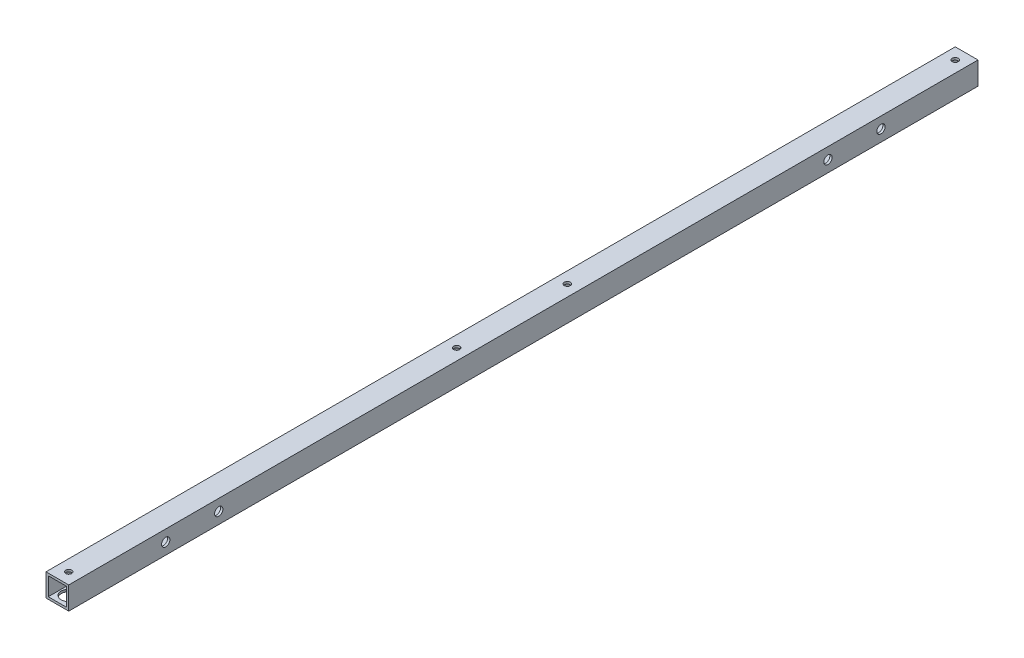
ISO-10303-21;
HEADER;
FILE_DESCRIPTION(('STEP AP214'),'2;1');
FILE_NAME('part.step','',(''),(''),'','','');
FILE_SCHEMA(('AUTOMOTIVE_DESIGN { 1 0 10303 214 1 1 1 1 }'));
ENDSEC;
DATA;
#1=APPLICATION_CONTEXT('core data for automotive mechanical design processes');
#2=APPLICATION_PROTOCOL_DEFINITION('international standard','automotive_design',2000,#1);
#3=PRODUCT_CONTEXT('',#1,'mechanical');
#4=PRODUCT('Part','Part','',(#3));
#5=PRODUCT_RELATED_PRODUCT_CATEGORY('part','',(#4));
#6=PRODUCT_DEFINITION_FORMATION('','',#4);
#7=PRODUCT_DEFINITION_CONTEXT('part definition',#1,'design');
#8=PRODUCT_DEFINITION('design','',#6,#7);
#9=PRODUCT_DEFINITION_SHAPE('','',#8);
#10=(LENGTH_UNIT() NAMED_UNIT(*) SI_UNIT(.MILLI.,.METRE.));
#11=(NAMED_UNIT(*) PLANE_ANGLE_UNIT() SI_UNIT($,.RADIAN.));
#12=(NAMED_UNIT(*) SI_UNIT($,.STERADIAN.) SOLID_ANGLE_UNIT());
#13=UNCERTAINTY_MEASURE_WITH_UNIT(LENGTH_MEASURE(1.E-05),#10,'distance_accuracy_value','');
#14=(GEOMETRIC_REPRESENTATION_CONTEXT(3) GLOBAL_UNCERTAINTY_ASSIGNED_CONTEXT((#13)) GLOBAL_UNIT_ASSIGNED_CONTEXT((#10,
#11,#12)) REPRESENTATION_CONTEXT('',''));
#15=CARTESIAN_POINT('',(0.,0.,0.));
#16=DIRECTION('',(0.,0.,1.));
#17=DIRECTION('',(1.,0.,0.));
#18=AXIS2_PLACEMENT_3D('',#15,#16,#17);
#19=CARTESIAN_POINT('',(0.,0.,600.));
#20=DIRECTION('',(0.,0.,-1.));
#21=DIRECTION('',(-1.,0.,0.));
#22=AXIS2_PLACEMENT_3D('',#19,#20,#21);
#23=PLANE('',#22);
#24=DIRECTION('',(0.,1.,0.));
#25=VECTOR('',#24,1.);
#26=CARTESIAN_POINT('',(7.5,-7.5,600.));
#27=LINE('',#26,#25);
#28=CARTESIAN_POINT('',(7.5,-7.5,600.));
#29=VERTEX_POINT('',#28);
#30=CARTESIAN_POINT('',(7.5,7.5,600.));
#31=VERTEX_POINT('',#30);
#32=EDGE_CURVE('E146',#29,#31,#27,.T.);
#33=ORIENTED_EDGE('',*,*,#32,.T.);
#34=DIRECTION('',(-1.,0.,0.));
#35=VECTOR('',#34,1.);
#36=CARTESIAN_POINT('',(-7.5,7.5,600.));
#37=LINE('',#36,#35);
#38=CARTESIAN_POINT('',(-7.5,7.5,600.));
#39=VERTEX_POINT('',#38);
#40=EDGE_CURVE('E149',#31,#39,#37,.T.);
#41=ORIENTED_EDGE('',*,*,#40,.T.);
#42=DIRECTION('',(0.,-1.,0.));
#43=VECTOR('',#42,1.);
#44=CARTESIAN_POINT('',(-7.5,-7.5,600.));
#45=LINE('',#44,#43);
#46=CARTESIAN_POINT('',(-7.5,-7.5,600.));
#47=VERTEX_POINT('',#46);
#48=EDGE_CURVE('E152',#39,#47,#45,.T.);
#49=ORIENTED_EDGE('',*,*,#48,.T.);
#50=DIRECTION('',(1.,0.,0.));
#51=VECTOR('',#50,1.);
#52=CARTESIAN_POINT('',(-7.5,-7.5,600.));
#53=LINE('',#52,#51);
#54=EDGE_CURVE('E154',#47,#29,#53,.T.);
#55=ORIENTED_EDGE('',*,*,#54,.T.);
#56=EDGE_LOOP('',(#33,#41,#49,#55));
#57=FACE_BOUND('',#56,.T.);
#58=DIRECTION('',(0.,1.,0.));
#59=VECTOR('',#58,1.);
#60=CARTESIAN_POINT('',(6.,-6.,600.));
#61=LINE('',#60,#59);
#62=CARTESIAN_POINT('',(6.,-6.,600.));
#63=VERTEX_POINT('',#62);
#64=CARTESIAN_POINT('',(6.,6.,600.));
#65=VERTEX_POINT('',#64);
#66=EDGE_CURVE('E108',#63,#65,#61,.T.);
#67=ORIENTED_EDGE('',*,*,#66,.F.);
#68=DIRECTION('',(1.,0.,0.));
#69=VECTOR('',#68,1.);
#70=CARTESIAN_POINT('',(-6.,-6.,600.));
#71=LINE('',#70,#69);
#72=CARTESIAN_POINT('',(-6.,-6.,600.));
#73=VERTEX_POINT('',#72);
#74=EDGE_CURVE('E130',#73,#63,#71,.T.);
#75=ORIENTED_EDGE('',*,*,#74,.F.);
#76=DIRECTION('',(0.,-1.,0.));
#77=VECTOR('',#76,1.);
#78=CARTESIAN_POINT('',(-6.,-6.,600.));
#79=LINE('',#78,#77);
#80=CARTESIAN_POINT('',(-6.,6.,600.));
#81=VERTEX_POINT('',#80);
#82=EDGE_CURVE('E128',#81,#73,#79,.T.);
#83=ORIENTED_EDGE('',*,*,#82,.F.);
#84=DIRECTION('',(-1.,0.,0.));
#85=VECTOR('',#84,1.);
#86=CARTESIAN_POINT('',(-6.,6.,600.));
#87=LINE('',#86,#85);
#88=EDGE_CURVE('E116',#65,#81,#87,.T.);
#89=ORIENTED_EDGE('',*,*,#88,.F.);
#90=EDGE_LOOP('',(#67,#75,#83,#89));
#91=FACE_BOUND('',#90,.T.);
#92=ADVANCED_FACE('F41',(#57,#91),#23,.F.);
#93=CARTESIAN_POINT('',(0.,0.,0.));
#94=DIRECTION('',(0.,0.,-1.));
#95=DIRECTION('',(-1.,0.,0.));
#96=AXIS2_PLACEMENT_3D('',#93,#94,#95);
#97=PLANE('',#96);
#98=DIRECTION('',(0.,1.,0.));
#99=VECTOR('',#98,1.);
#100=CARTESIAN_POINT('',(7.5,-7.5,0.));
#101=LINE('',#100,#99);
#102=CARTESIAN_POINT('',(7.5,-7.5,0.));
#103=VERTEX_POINT('',#102);
#104=CARTESIAN_POINT('',(7.5,7.5,0.));
#105=VERTEX_POINT('',#104);
#106=EDGE_CURVE('E124',#103,#105,#101,.T.);
#107=ORIENTED_EDGE('',*,*,#106,.F.);
#108=DIRECTION('',(1.,0.,0.));
#109=VECTOR('',#108,1.);
#110=CARTESIAN_POINT('',(-7.5,-7.5,0.));
#111=LINE('',#110,#109);
#112=CARTESIAN_POINT('',(-7.5,-7.5,0.));
#113=VERTEX_POINT('',#112);
#114=EDGE_CURVE('E150',#113,#103,#111,.T.);
#115=ORIENTED_EDGE('',*,*,#114,.F.);
#116=DIRECTION('',(0.,-1.,0.));
#117=VECTOR('',#116,1.);
#118=CARTESIAN_POINT('',(-7.5,-7.5,0.));
#119=LINE('',#118,#117);
#120=CARTESIAN_POINT('',(-7.5,7.5,0.));
#121=VERTEX_POINT('',#120);
#122=EDGE_CURVE('E161',#121,#113,#119,.T.);
#123=ORIENTED_EDGE('',*,*,#122,.F.);
#124=DIRECTION('',(-1.,0.,0.));
#125=VECTOR('',#124,1.);
#126=CARTESIAN_POINT('',(-7.5,7.5,0.));
#127=LINE('',#126,#125);
#128=EDGE_CURVE('E159',#105,#121,#127,.T.);
#129=ORIENTED_EDGE('',*,*,#128,.F.);
#130=EDGE_LOOP('',(#107,#115,#123,#129));
#131=FACE_BOUND('',#130,.T.);
#132=DIRECTION('',(1.,0.,0.));
#133=VECTOR('',#132,1.);
#134=CARTESIAN_POINT('',(-6.,-6.,0.));
#135=LINE('',#134,#133);
#136=CARTESIAN_POINT('',(-6.,-6.,0.));
#137=VERTEX_POINT('',#136);
#138=CARTESIAN_POINT('',(6.,-6.,0.));
#139=VERTEX_POINT('',#138);
#140=EDGE_CURVE('E117',#137,#139,#135,.T.);
#141=ORIENTED_EDGE('',*,*,#140,.T.);
#142=DIRECTION('',(0.,1.,0.));
#143=VECTOR('',#142,1.);
#144=CARTESIAN_POINT('',(6.,-6.,0.));
#145=LINE('',#144,#143);
#146=CARTESIAN_POINT('',(6.,6.,0.));
#147=VERTEX_POINT('',#146);
#148=EDGE_CURVE('E66',#139,#147,#145,.T.);
#149=ORIENTED_EDGE('',*,*,#148,.T.);
#150=DIRECTION('',(-1.,0.,0.));
#151=VECTOR('',#150,1.);
#152=CARTESIAN_POINT('',(-6.,6.,0.));
#153=LINE('',#152,#151);
#154=CARTESIAN_POINT('',(-6.,6.,0.));
#155=VERTEX_POINT('',#154);
#156=EDGE_CURVE('E123',#147,#155,#153,.T.);
#157=ORIENTED_EDGE('',*,*,#156,.T.);
#158=DIRECTION('',(0.,-1.,0.));
#159=VECTOR('',#158,1.);
#160=CARTESIAN_POINT('',(-6.,-6.,0.));
#161=LINE('',#160,#159);
#162=EDGE_CURVE('E138',#155,#137,#161,.T.);
#163=ORIENTED_EDGE('',*,*,#162,.T.);
#164=EDGE_LOOP('',(#141,#149,#157,#163));
#165=FACE_BOUND('',#164,.T.);
#166=ADVANCED_FACE('F290',(#131,#165),#97,.T.);
#167=CARTESIAN_POINT('',(7.5,-7.5,600.));
#168=DIRECTION('',(-1.,0.,0.));
#169=DIRECTION('',(0.,0.,1.));
#170=AXIS2_PLACEMENT_3D('',#167,#168,#169);
#171=PLANE('',#170);
#172=CARTESIAN_POINT('',(7.5,0.,536.));
#173=DIRECTION('',(1.,0.,0.));
#174=DIRECTION('',(0.,0.,-1.));
#175=AXIS2_PLACEMENT_3D('',#172,#173,#174);
#176=CIRCLE('',#175,2.75000000000004);
#177=CARTESIAN_POINT('',(7.5,0.,533.25));
#178=VERTEX_POINT('',#177);
#179=EDGE_CURVE('E175',#178,#178,#176,.T.);
#180=ORIENTED_EDGE('',*,*,#179,.F.);
#181=EDGE_LOOP('',(#180));
#182=FACE_BOUND('',#181,.T.);
#183=CARTESIAN_POINT('',(7.5,0.,501.));
#184=DIRECTION('',(1.,0.,0.));
#185=DIRECTION('',(0.,0.,-1.));
#186=AXIS2_PLACEMENT_3D('',#183,#184,#185);
#187=CIRCLE('',#186,2.74999999999998);
#188=CARTESIAN_POINT('',(7.5,0.,498.25));
#189=VERTEX_POINT('',#188);
#190=EDGE_CURVE('E223',#189,#189,#187,.T.);
#191=ORIENTED_EDGE('',*,*,#190,.F.);
#192=EDGE_LOOP('',(#191));
#193=FACE_BOUND('',#192,.T.);
#194=CARTESIAN_POINT('',(7.5,0.,99.));
#195=DIRECTION('',(1.,0.,0.));
#196=DIRECTION('',(0.,0.,-1.));
#197=AXIS2_PLACEMENT_3D('',#194,#195,#196);
#198=CIRCLE('',#197,2.75000000000001);
#199=CARTESIAN_POINT('',(7.5,0.,96.25));
#200=VERTEX_POINT('',#199);
#201=EDGE_CURVE('E226',#200,#200,#198,.T.);
#202=ORIENTED_EDGE('',*,*,#201,.F.);
#203=EDGE_LOOP('',(#202));
#204=FACE_BOUND('',#203,.T.);
#205=CARTESIAN_POINT('',(7.5,0.,64.));
#206=DIRECTION('',(1.,0.,0.));
#207=DIRECTION('',(0.,0.,-1.));
#208=AXIS2_PLACEMENT_3D('',#205,#206,#207);
#209=CIRCLE('',#208,2.75);
#210=CARTESIAN_POINT('',(7.5,0.,61.25));
#211=VERTEX_POINT('',#210);
#212=EDGE_CURVE('E220',#211,#211,#209,.T.);
#213=ORIENTED_EDGE('',*,*,#212,.F.);
#214=EDGE_LOOP('',(#213));
#215=FACE_BOUND('',#214,.T.);
#216=ORIENTED_EDGE('',*,*,#106,.T.);
#217=DIRECTION('',(0.,0.,-1.));
#218=VECTOR('',#217,1.);
#219=CARTESIAN_POINT('',(7.5,7.5,600.));
#220=LINE('',#219,#218);
#221=EDGE_CURVE('E11',#31,#105,#220,.T.);
#222=ORIENTED_EDGE('',*,*,#221,.F.);
#223=ORIENTED_EDGE('',*,*,#32,.F.);
#224=DIRECTION('',(0.,0.,-1.));
#225=VECTOR('',#224,1.);
#226=CARTESIAN_POINT('',(7.5,-7.5,600.));
#227=LINE('',#226,#225);
#228=EDGE_CURVE('E156',#29,#103,#227,.T.);
#229=ORIENTED_EDGE('',*,*,#228,.T.);
#230=EDGE_LOOP('',(#216,#222,#223,#229));
#231=FACE_BOUND('',#230,.T.);
#232=ADVANCED_FACE('F43',(#182,#193,#204,#215,#231),#171,.F.);
#233=CARTESIAN_POINT('',(-7.5,7.5,600.));
#234=DIRECTION('',(0.,-1.,0.));
#235=DIRECTION('',(0.,0.,-1.));
#236=AXIS2_PLACEMENT_3D('',#233,#234,#235);
#237=PLANE('',#236);
#238=CARTESIAN_POINT('',(0.,7.5,336.5));
#239=DIRECTION('',(0.,1.,0.));
#240=DIRECTION('',(0.,0.,1.));
#241=AXIS2_PLACEMENT_3D('',#238,#239,#240);
#242=CIRCLE('',#241,2.);
#243=CARTESIAN_POINT('',(0.,7.5,338.5));
#244=VERTEX_POINT('',#243);
#245=EDGE_CURVE('E206',#244,#244,#242,.T.);
#246=ORIENTED_EDGE('',*,*,#245,.F.);
#247=EDGE_LOOP('',(#246));
#248=FACE_BOUND('',#247,.T.);
#249=CARTESIAN_POINT('',(0.,7.5,263.5));
#250=DIRECTION('',(0.,1.,0.));
#251=DIRECTION('',(0.,0.,1.));
#252=AXIS2_PLACEMENT_3D('',#249,#250,#251);
#253=CIRCLE('',#252,2.);
#254=CARTESIAN_POINT('',(0.,7.5,265.5));
#255=VERTEX_POINT('',#254);
#256=EDGE_CURVE('E202',#255,#255,#253,.T.);
#257=ORIENTED_EDGE('',*,*,#256,.F.);
#258=EDGE_LOOP('',(#257));
#259=FACE_BOUND('',#258,.T.);
#260=CARTESIAN_POINT('',(0.,7.5,7.49999999999995));
#261=DIRECTION('',(0.,1.,0.));
#262=DIRECTION('',(0.,0.,1.));
#263=AXIS2_PLACEMENT_3D('',#260,#261,#262);
#264=CIRCLE('',#263,2.);
#265=CARTESIAN_POINT('',(0.,7.5,9.49999999999995));
#266=VERTEX_POINT('',#265);
#267=EDGE_CURVE('E249',#266,#266,#264,.T.);
#268=ORIENTED_EDGE('',*,*,#267,.F.);
#269=EDGE_LOOP('',(#268));
#270=FACE_BOUND('',#269,.T.);
#271=CARTESIAN_POINT('',(0.,7.5,592.5));
#272=DIRECTION('',(0.,1.,0.));
#273=DIRECTION('',(0.,0.,1.));
#274=AXIS2_PLACEMENT_3D('',#271,#272,#273);
#275=CIRCLE('',#274,2.);
#276=CARTESIAN_POINT('',(0.,7.5,594.5));
#277=VERTEX_POINT('',#276);
#278=EDGE_CURVE('E248',#277,#277,#275,.T.);
#279=ORIENTED_EDGE('',*,*,#278,.F.);
#280=EDGE_LOOP('',(#279));
#281=FACE_BOUND('',#280,.T.);
#282=ORIENTED_EDGE('',*,*,#128,.T.);
#283=DIRECTION('',(0.,0.,-1.));
#284=VECTOR('',#283,1.);
#285=CARTESIAN_POINT('',(-7.5,7.5,600.));
#286=LINE('',#285,#284);
#287=EDGE_CURVE('E50',#39,#121,#286,.T.);
#288=ORIENTED_EDGE('',*,*,#287,.F.);
#289=ORIENTED_EDGE('',*,*,#40,.F.);
#290=ORIENTED_EDGE('',*,*,#221,.T.);
#291=EDGE_LOOP('',(#282,#288,#289,#290));
#292=FACE_BOUND('',#291,.T.);
#293=ADVANCED_FACE('F276',(#248,#259,#270,#281,#292),#237,.F.);
#294=CARTESIAN_POINT('',(-7.5,-7.5,600.));
#295=DIRECTION('',(1.,0.,0.));
#296=DIRECTION('',(0.,0.,-1.));
#297=AXIS2_PLACEMENT_3D('',#294,#295,#296);
#298=PLANE('',#297);
#299=CARTESIAN_POINT('',(-7.5,0.,536.));
#300=DIRECTION('',(1.,0.,0.));
#301=DIRECTION('',(0.,0.,-1.));
#302=AXIS2_PLACEMENT_3D('',#299,#300,#301);
#303=CIRCLE('',#302,2.75000000000004);
#304=CARTESIAN_POINT('',(-7.5,0.,533.25));
#305=VERTEX_POINT('',#304);
#306=EDGE_CURVE('E245',#305,#305,#303,.T.);
#307=ORIENTED_EDGE('',*,*,#306,.T.);
#308=EDGE_LOOP('',(#307));
#309=FACE_BOUND('',#308,.T.);
#310=CARTESIAN_POINT('',(-7.5,0.,501.));
#311=DIRECTION('',(1.,0.,0.));
#312=DIRECTION('',(0.,0.,-1.));
#313=AXIS2_PLACEMENT_3D('',#310,#311,#312);
#314=CIRCLE('',#313,2.74999999999998);
#315=CARTESIAN_POINT('',(-7.5,0.,498.25));
#316=VERTEX_POINT('',#315);
#317=EDGE_CURVE('E190',#316,#316,#314,.T.);
#318=ORIENTED_EDGE('',*,*,#317,.T.);
#319=EDGE_LOOP('',(#318));
#320=FACE_BOUND('',#319,.T.);
#321=CARTESIAN_POINT('',(-7.5,0.,99.));
#322=DIRECTION('',(1.,0.,0.));
#323=DIRECTION('',(0.,0.,-1.));
#324=AXIS2_PLACEMENT_3D('',#321,#322,#323);
#325=CIRCLE('',#324,2.75000000000001);
#326=CARTESIAN_POINT('',(-7.5,0.,96.25));
#327=VERTEX_POINT('',#326);
#328=EDGE_CURVE('E185',#327,#327,#325,.T.);
#329=ORIENTED_EDGE('',*,*,#328,.T.);
#330=EDGE_LOOP('',(#329));
#331=FACE_BOUND('',#330,.T.);
#332=CARTESIAN_POINT('',(-7.5,0.,64.));
#333=DIRECTION('',(1.,0.,0.));
#334=DIRECTION('',(0.,0.,-1.));
#335=AXIS2_PLACEMENT_3D('',#332,#333,#334);
#336=CIRCLE('',#335,2.75);
#337=CARTESIAN_POINT('',(-7.5,0.,61.25));
#338=VERTEX_POINT('',#337);
#339=EDGE_CURVE('E180',#338,#338,#336,.T.);
#340=ORIENTED_EDGE('',*,*,#339,.T.);
#341=EDGE_LOOP('',(#340));
#342=FACE_BOUND('',#341,.T.);
#343=ORIENTED_EDGE('',*,*,#122,.T.);
#344=DIRECTION('',(0.,0.,-1.));
#345=VECTOR('',#344,1.);
#346=CARTESIAN_POINT('',(-7.5,-7.5,600.));
#347=LINE('',#346,#345);
#348=EDGE_CURVE('E166',#47,#113,#347,.T.);
#349=ORIENTED_EDGE('',*,*,#348,.F.);
#350=ORIENTED_EDGE('',*,*,#48,.F.);
#351=ORIENTED_EDGE('',*,*,#287,.T.);
#352=EDGE_LOOP('',(#343,#349,#350,#351));
#353=FACE_BOUND('',#352,.T.);
#354=ADVANCED_FACE('F279',(#309,#320,#331,#342,#353),#298,.F.);
#355=CARTESIAN_POINT('',(-7.5,-7.5,600.));
#356=DIRECTION('',(0.,1.,0.));
#357=DIRECTION('',(0.,0.,1.));
#358=AXIS2_PLACEMENT_3D('',#355,#356,#357);
#359=PLANE('',#358);
#360=CARTESIAN_POINT('',(0.,-7.5,592.5));
#361=DIRECTION('',(0.,-1.,0.));
#362=DIRECTION('',(0.,0.,-1.));
#363=AXIS2_PLACEMENT_3D('',#360,#361,#362);
#364=CIRCLE('',#363,5.);
#365=CARTESIAN_POINT('',(0.,-7.5,587.5));
#366=VERTEX_POINT('',#365);
#367=EDGE_CURVE('E195',#366,#366,#364,.T.);
#368=ORIENTED_EDGE('',*,*,#367,.F.);
#369=EDGE_LOOP('',(#368));
#370=FACE_BOUND('',#369,.T.);
#371=CARTESIAN_POINT('',(0.,-7.5,336.5));
#372=DIRECTION('',(0.,-1.,0.));
#373=DIRECTION('',(0.,0.,-1.));
#374=AXIS2_PLACEMENT_3D('',#371,#372,#373);
#375=CIRCLE('',#374,5.);
#376=CARTESIAN_POINT('',(0.,-7.5,331.5));
#377=VERTEX_POINT('',#376);
#378=EDGE_CURVE('E412',#377,#377,#375,.T.);
#379=ORIENTED_EDGE('',*,*,#378,.F.);
#380=EDGE_LOOP('',(#379));
#381=FACE_BOUND('',#380,.T.);
#382=CARTESIAN_POINT('',(0.,-7.5,263.5));
#383=DIRECTION('',(0.,-1.,0.));
#384=DIRECTION('',(0.,0.,-1.));
#385=AXIS2_PLACEMENT_3D('',#382,#383,#384);
#386=CIRCLE('',#385,5.);
#387=CARTESIAN_POINT('',(0.,-7.5,258.5));
#388=VERTEX_POINT('',#387);
#389=EDGE_CURVE('E410',#388,#388,#386,.T.);
#390=ORIENTED_EDGE('',*,*,#389,.F.);
#391=EDGE_LOOP('',(#390));
#392=FACE_BOUND('',#391,.T.);
#393=CARTESIAN_POINT('',(0.,-7.5,7.49999999999995));
#394=DIRECTION('',(0.,-1.,0.));
#395=DIRECTION('',(0.,0.,-1.));
#396=AXIS2_PLACEMENT_3D('',#393,#394,#395);
#397=CIRCLE('',#396,5.);
#398=CARTESIAN_POINT('',(0.,-7.5,2.49999999999995));
#399=VERTEX_POINT('',#398);
#400=EDGE_CURVE('E408',#399,#399,#397,.T.);
#401=ORIENTED_EDGE('',*,*,#400,.F.);
#402=EDGE_LOOP('',(#401));
#403=FACE_BOUND('',#402,.T.);
#404=ORIENTED_EDGE('',*,*,#114,.T.);
#405=ORIENTED_EDGE('',*,*,#228,.F.);
#406=ORIENTED_EDGE('',*,*,#54,.F.);
#407=ORIENTED_EDGE('',*,*,#348,.T.);
#408=EDGE_LOOP('',(#404,#405,#406,#407));
#409=FACE_BOUND('',#408,.T.);
#410=ADVANCED_FACE('F294',(#370,#381,#392,#403,#409),#359,.F.);
#411=CARTESIAN_POINT('',(6.,-6.,600.));
#412=DIRECTION('',(-1.,0.,0.));
#413=DIRECTION('',(0.,0.,1.));
#414=AXIS2_PLACEMENT_3D('',#411,#412,#413);
#415=PLANE('',#414);
#416=CARTESIAN_POINT('',(6.,0.,536.));
#417=DIRECTION('',(-1.,0.,0.));
#418=DIRECTION('',(0.,0.,1.));
#419=AXIS2_PLACEMENT_3D('',#416,#417,#418);
#420=CIRCLE('',#419,2.75000000000004);
#421=CARTESIAN_POINT('',(6.,0.,538.75));
#422=VERTEX_POINT('',#421);
#423=EDGE_CURVE('E189',#422,#422,#420,.T.);
#424=ORIENTED_EDGE('',*,*,#423,.F.);
#425=EDGE_LOOP('',(#424));
#426=FACE_BOUND('',#425,.T.);
#427=CARTESIAN_POINT('',(6.,0.,501.));
#428=DIRECTION('',(-1.,0.,0.));
#429=DIRECTION('',(0.,0.,1.));
#430=AXIS2_PLACEMENT_3D('',#427,#428,#429);
#431=CIRCLE('',#430,2.74999999999998);
#432=CARTESIAN_POINT('',(6.,0.,503.75));
#433=VERTEX_POINT('',#432);
#434=EDGE_CURVE('E184',#433,#433,#431,.T.);
#435=ORIENTED_EDGE('',*,*,#434,.F.);
#436=EDGE_LOOP('',(#435));
#437=FACE_BOUND('',#436,.T.);
#438=CARTESIAN_POINT('',(6.,0.,99.));
#439=DIRECTION('',(-1.,0.,0.));
#440=DIRECTION('',(0.,0.,1.));
#441=AXIS2_PLACEMENT_3D('',#438,#439,#440);
#442=CIRCLE('',#441,2.75000000000001);
#443=CARTESIAN_POINT('',(6.,0.,101.75));
#444=VERTEX_POINT('',#443);
#445=EDGE_CURVE('E179',#444,#444,#442,.T.);
#446=ORIENTED_EDGE('',*,*,#445,.F.);
#447=EDGE_LOOP('',(#446));
#448=FACE_BOUND('',#447,.T.);
#449=CARTESIAN_POINT('',(6.,0.,64.));
#450=DIRECTION('',(-1.,0.,0.));
#451=DIRECTION('',(0.,0.,1.));
#452=AXIS2_PLACEMENT_3D('',#449,#450,#451);
#453=CIRCLE('',#452,2.75);
#454=CARTESIAN_POINT('',(6.,0.,66.75));
#455=VERTEX_POINT('',#454);
#456=EDGE_CURVE('E174',#455,#455,#453,.T.);
#457=ORIENTED_EDGE('',*,*,#456,.F.);
#458=EDGE_LOOP('',(#457));
#459=FACE_BOUND('',#458,.T.);
#460=ORIENTED_EDGE('',*,*,#148,.F.);
#461=DIRECTION('',(0.,0.,-1.));
#462=VECTOR('',#461,1.);
#463=CARTESIAN_POINT('',(6.,-6.,600.));
#464=LINE('',#463,#462);
#465=EDGE_CURVE('E112',#63,#139,#464,.T.);
#466=ORIENTED_EDGE('',*,*,#465,.F.);
#467=ORIENTED_EDGE('',*,*,#66,.T.);
#468=DIRECTION('',(0.,0.,-1.));
#469=VECTOR('',#468,1.);
#470=CARTESIAN_POINT('',(6.,6.,600.));
#471=LINE('',#470,#469);
#472=EDGE_CURVE('E111',#65,#147,#471,.T.);
#473=ORIENTED_EDGE('',*,*,#472,.T.);
#474=EDGE_LOOP('',(#460,#466,#467,#473));
#475=FACE_BOUND('',#474,.T.);
#476=ADVANCED_FACE('F110',(#426,#437,#448,#459,#475),#415,.T.);
#477=CARTESIAN_POINT('',(-6.,6.,600.));
#478=DIRECTION('',(0.,-1.,0.));
#479=DIRECTION('',(0.,0.,-1.));
#480=AXIS2_PLACEMENT_3D('',#477,#478,#479);
#481=PLANE('',#480);
#482=CARTESIAN_POINT('',(0.,6.,336.5));
#483=DIRECTION('',(0.,-1.,0.));
#484=DIRECTION('',(0.,0.,-1.));
#485=AXIS2_PLACEMENT_3D('',#482,#483,#484);
#486=CIRCLE('',#485,2.);
#487=CARTESIAN_POINT('',(0.,6.,334.5));
#488=VERTEX_POINT('',#487);
#489=EDGE_CURVE('E217',#488,#488,#486,.T.);
#490=ORIENTED_EDGE('',*,*,#489,.F.);
#491=EDGE_LOOP('',(#490));
#492=FACE_BOUND('',#491,.T.);
#493=CARTESIAN_POINT('',(0.,6.,263.5));
#494=DIRECTION('',(0.,-1.,0.));
#495=DIRECTION('',(0.,0.,-1.));
#496=AXIS2_PLACEMENT_3D('',#493,#494,#495);
#497=CIRCLE('',#496,2.);
#498=CARTESIAN_POINT('',(0.,6.,261.5));
#499=VERTEX_POINT('',#498);
#500=EDGE_CURVE('E211',#499,#499,#497,.T.);
#501=ORIENTED_EDGE('',*,*,#500,.F.);
#502=EDGE_LOOP('',(#501));
#503=FACE_BOUND('',#502,.T.);
#504=CARTESIAN_POINT('',(0.,6.,7.49999999999995));
#505=DIRECTION('',(0.,-1.,0.));
#506=DIRECTION('',(0.,0.,-1.));
#507=AXIS2_PLACEMENT_3D('',#504,#505,#506);
#508=CIRCLE('',#507,2.);
#509=CARTESIAN_POINT('',(0.,6.,5.49999999999995));
#510=VERTEX_POINT('',#509);
#511=EDGE_CURVE('E136',#510,#510,#508,.T.);
#512=ORIENTED_EDGE('',*,*,#511,.F.);
#513=EDGE_LOOP('',(#512));
#514=FACE_BOUND('',#513,.T.);
#515=CARTESIAN_POINT('',(0.,6.,592.5));
#516=DIRECTION('',(0.,-1.,0.));
#517=DIRECTION('',(0.,0.,-1.));
#518=AXIS2_PLACEMENT_3D('',#515,#516,#517);
#519=CIRCLE('',#518,2.);
#520=CARTESIAN_POINT('',(0.,6.,590.5));
#521=VERTEX_POINT('',#520);
#522=EDGE_CURVE('E252',#521,#521,#519,.T.);
#523=ORIENTED_EDGE('',*,*,#522,.F.);
#524=EDGE_LOOP('',(#523));
#525=FACE_BOUND('',#524,.T.);
#526=ORIENTED_EDGE('',*,*,#156,.F.);
#527=ORIENTED_EDGE('',*,*,#472,.F.);
#528=ORIENTED_EDGE('',*,*,#88,.T.);
#529=DIRECTION('',(0.,0.,-1.));
#530=VECTOR('',#529,1.);
#531=CARTESIAN_POINT('',(-6.,6.,600.));
#532=LINE('',#531,#530);
#533=EDGE_CURVE('E125',#81,#155,#532,.T.);
#534=ORIENTED_EDGE('',*,*,#533,.T.);
#535=EDGE_LOOP('',(#526,#527,#528,#534));
#536=FACE_BOUND('',#535,.T.);
#537=ADVANCED_FACE('F120',(#492,#503,#514,#525,#536),#481,.T.);
#538=CARTESIAN_POINT('',(-6.,-6.,600.));
#539=DIRECTION('',(1.,0.,0.));
#540=DIRECTION('',(0.,0.,-1.));
#541=AXIS2_PLACEMENT_3D('',#538,#539,#540);
#542=PLANE('',#541);
#543=CARTESIAN_POINT('',(-6.,0.,536.));
#544=DIRECTION('',(1.,0.,0.));
#545=DIRECTION('',(0.,0.,-1.));
#546=AXIS2_PLACEMENT_3D('',#543,#544,#545);
#547=CIRCLE('',#546,2.75000000000004);
#548=CARTESIAN_POINT('',(-6.,0.,533.25));
#549=VERTEX_POINT('',#548);
#550=EDGE_CURVE('E186',#549,#549,#547,.T.);
#551=ORIENTED_EDGE('',*,*,#550,.F.);
#552=EDGE_LOOP('',(#551));
#553=FACE_BOUND('',#552,.T.);
#554=CARTESIAN_POINT('',(-6.,0.,501.));
#555=DIRECTION('',(1.,0.,0.));
#556=DIRECTION('',(0.,0.,-1.));
#557=AXIS2_PLACEMENT_3D('',#554,#555,#556);
#558=CIRCLE('',#557,2.74999999999998);
#559=CARTESIAN_POINT('',(-6.,0.,498.25));
#560=VERTEX_POINT('',#559);
#561=EDGE_CURVE('E181',#560,#560,#558,.T.);
#562=ORIENTED_EDGE('',*,*,#561,.F.);
#563=EDGE_LOOP('',(#562));
#564=FACE_BOUND('',#563,.T.);
#565=CARTESIAN_POINT('',(-6.,0.,99.));
#566=DIRECTION('',(1.,0.,0.));
#567=DIRECTION('',(0.,0.,-1.));
#568=AXIS2_PLACEMENT_3D('',#565,#566,#567);
#569=CIRCLE('',#568,2.75000000000001);
#570=CARTESIAN_POINT('',(-6.,0.,96.25));
#571=VERTEX_POINT('',#570);
#572=EDGE_CURVE('E176',#571,#571,#569,.T.);
#573=ORIENTED_EDGE('',*,*,#572,.F.);
#574=EDGE_LOOP('',(#573));
#575=FACE_BOUND('',#574,.T.);
#576=CARTESIAN_POINT('',(-6.,0.,64.));
#577=DIRECTION('',(1.,0.,0.));
#578=DIRECTION('',(0.,0.,-1.));
#579=AXIS2_PLACEMENT_3D('',#576,#577,#578);
#580=CIRCLE('',#579,2.75);
#581=CARTESIAN_POINT('',(-6.,0.,61.25));
#582=VERTEX_POINT('',#581);
#583=EDGE_CURVE('E171',#582,#582,#580,.T.);
#584=ORIENTED_EDGE('',*,*,#583,.F.);
#585=EDGE_LOOP('',(#584));
#586=FACE_BOUND('',#585,.T.);
#587=ORIENTED_EDGE('',*,*,#162,.F.);
#588=ORIENTED_EDGE('',*,*,#533,.F.);
#589=ORIENTED_EDGE('',*,*,#82,.T.);
#590=DIRECTION('',(0.,0.,-1.));
#591=VECTOR('',#590,1.);
#592=CARTESIAN_POINT('',(-6.,-6.,600.));
#593=LINE('',#592,#591);
#594=EDGE_CURVE('E58',#73,#137,#593,.T.);
#595=ORIENTED_EDGE('',*,*,#594,.T.);
#596=EDGE_LOOP('',(#587,#588,#589,#595));
#597=FACE_BOUND('',#596,.T.);
#598=ADVANCED_FACE('F264',(#553,#564,#575,#586,#597),#542,.T.);
#599=CARTESIAN_POINT('',(-6.,-6.,600.));
#600=DIRECTION('',(0.,1.,0.));
#601=DIRECTION('',(0.,0.,1.));
#602=AXIS2_PLACEMENT_3D('',#599,#600,#601);
#603=PLANE('',#602);
#604=CARTESIAN_POINT('',(0.,-6.,592.5));
#605=DIRECTION('',(0.,1.,0.));
#606=DIRECTION('',(0.,0.,1.));
#607=AXIS2_PLACEMENT_3D('',#604,#605,#606);
#608=CIRCLE('',#607,5.);
#609=CARTESIAN_POINT('',(0.,-6.,597.5));
#610=VERTEX_POINT('',#609);
#611=EDGE_CURVE('E45',#610,#610,#608,.T.);
#612=ORIENTED_EDGE('',*,*,#611,.F.);
#613=EDGE_LOOP('',(#612));
#614=FACE_BOUND('',#613,.T.);
#615=CARTESIAN_POINT('',(0.,-6.,336.5));
#616=DIRECTION('',(0.,1.,0.));
#617=DIRECTION('',(0.,0.,1.));
#618=AXIS2_PLACEMENT_3D('',#615,#616,#617);
#619=CIRCLE('',#618,5.);
#620=CARTESIAN_POINT('',(0.,-6.,341.5));
#621=VERTEX_POINT('',#620);
#622=EDGE_CURVE('E197',#621,#621,#619,.T.);
#623=ORIENTED_EDGE('',*,*,#622,.F.);
#624=EDGE_LOOP('',(#623));
#625=FACE_BOUND('',#624,.T.);
#626=CARTESIAN_POINT('',(0.,-6.,263.5));
#627=DIRECTION('',(0.,1.,0.));
#628=DIRECTION('',(0.,0.,1.));
#629=AXIS2_PLACEMENT_3D('',#626,#627,#628);
#630=CIRCLE('',#629,5.);
#631=CARTESIAN_POINT('',(0.,-6.,268.5));
#632=VERTEX_POINT('',#631);
#633=EDGE_CURVE('E194',#632,#632,#630,.T.);
#634=ORIENTED_EDGE('',*,*,#633,.F.);
#635=EDGE_LOOP('',(#634));
#636=FACE_BOUND('',#635,.T.);
#637=CARTESIAN_POINT('',(0.,-6.,7.49999999999995));
#638=DIRECTION('',(0.,1.,0.));
#639=DIRECTION('',(0.,0.,1.));
#640=AXIS2_PLACEMENT_3D('',#637,#638,#639);
#641=CIRCLE('',#640,5.);
#642=CARTESIAN_POINT('',(0.,-6.,12.5));
#643=VERTEX_POINT('',#642);
#644=EDGE_CURVE('E191',#643,#643,#641,.T.);
#645=ORIENTED_EDGE('',*,*,#644,.F.);
#646=EDGE_LOOP('',(#645));
#647=FACE_BOUND('',#646,.T.);
#648=ORIENTED_EDGE('',*,*,#140,.F.);
#649=ORIENTED_EDGE('',*,*,#594,.F.);
#650=ORIENTED_EDGE('',*,*,#74,.T.);
#651=ORIENTED_EDGE('',*,*,#465,.T.);
#652=EDGE_LOOP('',(#648,#649,#650,#651));
#653=FACE_BOUND('',#652,.T.);
#654=ADVANCED_FACE('F272',(#614,#625,#636,#647,#653),#603,.T.);
#655=CARTESIAN_POINT('',(0.,-17.5,592.5));
#656=DIRECTION('',(0.,1.,0.));
#657=DIRECTION('',(0.,0.,1.));
#658=AXIS2_PLACEMENT_3D('',#655,#656,#657);
#659=CYLINDRICAL_SURFACE('',#658,2.);
#660=ORIENTED_EDGE('',*,*,#522,.T.);
#661=EDGE_LOOP('',(#660));
#662=FACE_BOUND('',#661,.T.);
#663=ORIENTED_EDGE('',*,*,#278,.T.);
#664=EDGE_LOOP('',(#663));
#665=FACE_BOUND('',#664,.T.);
#666=ADVANCED_FACE('F269',(#662,#665),#659,.F.);
#667=CARTESIAN_POINT('',(0.,-17.5,7.49999999999995));
#668=DIRECTION('',(0.,1.,0.));
#669=DIRECTION('',(0.,0.,1.));
#670=AXIS2_PLACEMENT_3D('',#667,#668,#669);
#671=CYLINDRICAL_SURFACE('',#670,2.);
#672=ORIENTED_EDGE('',*,*,#511,.T.);
#673=EDGE_LOOP('',(#672));
#674=FACE_BOUND('',#673,.T.);
#675=ORIENTED_EDGE('',*,*,#267,.T.);
#676=EDGE_LOOP('',(#675));
#677=FACE_BOUND('',#676,.T.);
#678=ADVANCED_FACE('F259',(#674,#677),#671,.F.);
#679=CARTESIAN_POINT('',(-12.5,0.,64.));
#680=DIRECTION('',(1.,0.,0.));
#681=DIRECTION('',(0.,0.,-1.));
#682=AXIS2_PLACEMENT_3D('',#679,#680,#681);
#683=CYLINDRICAL_SURFACE('',#682,2.75);
#684=ORIENTED_EDGE('',*,*,#583,.T.);
#685=EDGE_LOOP('',(#684));
#686=FACE_BOUND('',#685,.T.);
#687=ORIENTED_EDGE('',*,*,#339,.F.);
#688=EDGE_LOOP('',(#687));
#689=FACE_BOUND('',#688,.T.);
#690=ADVANCED_FACE('F324',(#686,#689),#683,.F.);
#691=CARTESIAN_POINT('',(-12.5,0.,99.));
#692=DIRECTION('',(1.,0.,0.));
#693=DIRECTION('',(0.,0.,-1.));
#694=AXIS2_PLACEMENT_3D('',#691,#692,#693);
#695=CYLINDRICAL_SURFACE('',#694,2.75000000000001);
#696=ORIENTED_EDGE('',*,*,#572,.T.);
#697=EDGE_LOOP('',(#696));
#698=FACE_BOUND('',#697,.T.);
#699=ORIENTED_EDGE('',*,*,#328,.F.);
#700=EDGE_LOOP('',(#699));
#701=FACE_BOUND('',#700,.T.);
#702=ADVANCED_FACE('F326',(#698,#701),#695,.F.);
#703=CARTESIAN_POINT('',(-12.5,0.,501.));
#704=DIRECTION('',(1.,0.,0.));
#705=DIRECTION('',(0.,0.,-1.));
#706=AXIS2_PLACEMENT_3D('',#703,#704,#705);
#707=CYLINDRICAL_SURFACE('',#706,2.74999999999998);
#708=ORIENTED_EDGE('',*,*,#561,.T.);
#709=EDGE_LOOP('',(#708));
#710=FACE_BOUND('',#709,.T.);
#711=ORIENTED_EDGE('',*,*,#317,.F.);
#712=EDGE_LOOP('',(#711));
#713=FACE_BOUND('',#712,.T.);
#714=ADVANCED_FACE('F334',(#710,#713),#707,.F.);
#715=CARTESIAN_POINT('',(-12.5,0.,536.));
#716=DIRECTION('',(1.,0.,0.));
#717=DIRECTION('',(0.,0.,-1.));
#718=AXIS2_PLACEMENT_3D('',#715,#716,#717);
#719=CYLINDRICAL_SURFACE('',#718,2.75000000000004);
#720=ORIENTED_EDGE('',*,*,#550,.T.);
#721=EDGE_LOOP('',(#720));
#722=FACE_BOUND('',#721,.T.);
#723=ORIENTED_EDGE('',*,*,#306,.F.);
#724=EDGE_LOOP('',(#723));
#725=FACE_BOUND('',#724,.T.);
#726=ADVANCED_FACE('F341',(#722,#725),#719,.F.);
#727=ORIENTED_EDGE('',*,*,#456,.T.);
#728=EDGE_LOOP('',(#727));
#729=FACE_BOUND('',#728,.T.);
#730=ORIENTED_EDGE('',*,*,#212,.T.);
#731=EDGE_LOOP('',(#730));
#732=FACE_BOUND('',#731,.T.);
#733=ADVANCED_FACE('F329',(#729,#732),#683,.F.);
#734=ORIENTED_EDGE('',*,*,#445,.T.);
#735=EDGE_LOOP('',(#734));
#736=FACE_BOUND('',#735,.T.);
#737=ORIENTED_EDGE('',*,*,#201,.T.);
#738=EDGE_LOOP('',(#737));
#739=FACE_BOUND('',#738,.T.);
#740=ADVANCED_FACE('F337',(#736,#739),#695,.F.);
#741=ORIENTED_EDGE('',*,*,#434,.T.);
#742=EDGE_LOOP('',(#741));
#743=FACE_BOUND('',#742,.T.);
#744=ORIENTED_EDGE('',*,*,#190,.T.);
#745=EDGE_LOOP('',(#744));
#746=FACE_BOUND('',#745,.T.);
#747=ADVANCED_FACE('F347',(#743,#746),#707,.F.);
#748=ORIENTED_EDGE('',*,*,#423,.T.);
#749=EDGE_LOOP('',(#748));
#750=FACE_BOUND('',#749,.T.);
#751=ORIENTED_EDGE('',*,*,#179,.T.);
#752=EDGE_LOOP('',(#751));
#753=FACE_BOUND('',#752,.T.);
#754=ADVANCED_FACE('F351',(#750,#753),#719,.F.);
#755=CARTESIAN_POINT('',(0.,-12.5,263.5));
#756=DIRECTION('',(0.,1.,0.));
#757=DIRECTION('',(0.,0.,1.));
#758=AXIS2_PLACEMENT_3D('',#755,#756,#757);
#759=CYLINDRICAL_SURFACE('',#758,2.);
#760=ORIENTED_EDGE('',*,*,#500,.T.);
#761=EDGE_LOOP('',(#760));
#762=FACE_BOUND('',#761,.T.);
#763=ORIENTED_EDGE('',*,*,#256,.T.);
#764=EDGE_LOOP('',(#763));
#765=FACE_BOUND('',#764,.T.);
#766=ADVANCED_FACE('F372',(#762,#765),#759,.F.);
#767=CARTESIAN_POINT('',(0.,-12.5,336.5));
#768=DIRECTION('',(0.,1.,0.));
#769=DIRECTION('',(0.,0.,1.));
#770=AXIS2_PLACEMENT_3D('',#767,#768,#769);
#771=CYLINDRICAL_SURFACE('',#770,2.);
#772=ORIENTED_EDGE('',*,*,#489,.T.);
#773=EDGE_LOOP('',(#772));
#774=FACE_BOUND('',#773,.T.);
#775=ORIENTED_EDGE('',*,*,#245,.T.);
#776=EDGE_LOOP('',(#775));
#777=FACE_BOUND('',#776,.T.);
#778=ADVANCED_FACE('F404',(#774,#777),#771,.F.);
#779=CARTESIAN_POINT('',(0.,2.5,7.49999999999995));
#780=DIRECTION('',(0.,-1.,0.));
#781=DIRECTION('',(0.,0.,-1.));
#782=AXIS2_PLACEMENT_3D('',#779,#780,#781);
#783=CYLINDRICAL_SURFACE('',#782,5.);
#784=ORIENTED_EDGE('',*,*,#644,.T.);
#785=EDGE_LOOP('',(#784));
#786=FACE_BOUND('',#785,.T.);
#787=ORIENTED_EDGE('',*,*,#400,.T.);
#788=EDGE_LOOP('',(#787));
#789=FACE_BOUND('',#788,.T.);
#790=ADVANCED_FACE('F401',(#786,#789),#783,.F.);
#791=CARTESIAN_POINT('',(0.,2.5,263.5));
#792=DIRECTION('',(0.,-1.,0.));
#793=DIRECTION('',(0.,0.,-1.));
#794=AXIS2_PLACEMENT_3D('',#791,#792,#793);
#795=CYLINDRICAL_SURFACE('',#794,5.);
#796=ORIENTED_EDGE('',*,*,#633,.T.);
#797=EDGE_LOOP('',(#796));
#798=FACE_BOUND('',#797,.T.);
#799=ORIENTED_EDGE('',*,*,#389,.T.);
#800=EDGE_LOOP('',(#799));
#801=FACE_BOUND('',#800,.T.);
#802=ADVANCED_FACE('F403',(#798,#801),#795,.F.);
#803=CARTESIAN_POINT('',(0.,2.5,336.5));
#804=DIRECTION('',(0.,-1.,0.));
#805=DIRECTION('',(0.,0.,-1.));
#806=AXIS2_PLACEMENT_3D('',#803,#804,#805);
#807=CYLINDRICAL_SURFACE('',#806,5.);
#808=ORIENTED_EDGE('',*,*,#622,.T.);
#809=EDGE_LOOP('',(#808));
#810=FACE_BOUND('',#809,.T.);
#811=ORIENTED_EDGE('',*,*,#378,.T.);
#812=EDGE_LOOP('',(#811));
#813=FACE_BOUND('',#812,.T.);
#814=ADVANCED_FACE('F427',(#810,#813),#807,.F.);
#815=CARTESIAN_POINT('',(0.,2.5,592.5));
#816=DIRECTION('',(0.,-1.,0.));
#817=DIRECTION('',(0.,0.,-1.));
#818=AXIS2_PLACEMENT_3D('',#815,#816,#817);
#819=CYLINDRICAL_SURFACE('',#818,5.);
#820=ORIENTED_EDGE('',*,*,#611,.T.);
#821=EDGE_LOOP('',(#820));
#822=FACE_BOUND('',#821,.T.);
#823=ORIENTED_EDGE('',*,*,#367,.T.);
#824=EDGE_LOOP('',(#823));
#825=FACE_BOUND('',#824,.T.);
#826=ADVANCED_FACE('F420',(#822,#825),#819,.F.);
#827=CLOSED_SHELL('',(#92,#166,#232,#293,#354,#410,#476,#537,#598,#654,#666,#678,#690,#702,#714,
#726,#733,#740,#747,#754,#766,#778,#790,#802,#814,#826));
#828=MANIFOLD_SOLID_BREP('B2',#827);
#829=ADVANCED_BREP_SHAPE_REPRESENTATION('',(#18,#828),#14);
#830=SHAPE_DEFINITION_REPRESENTATION(#9,#829);
ENDSEC;
END-ISO-10303-21;
